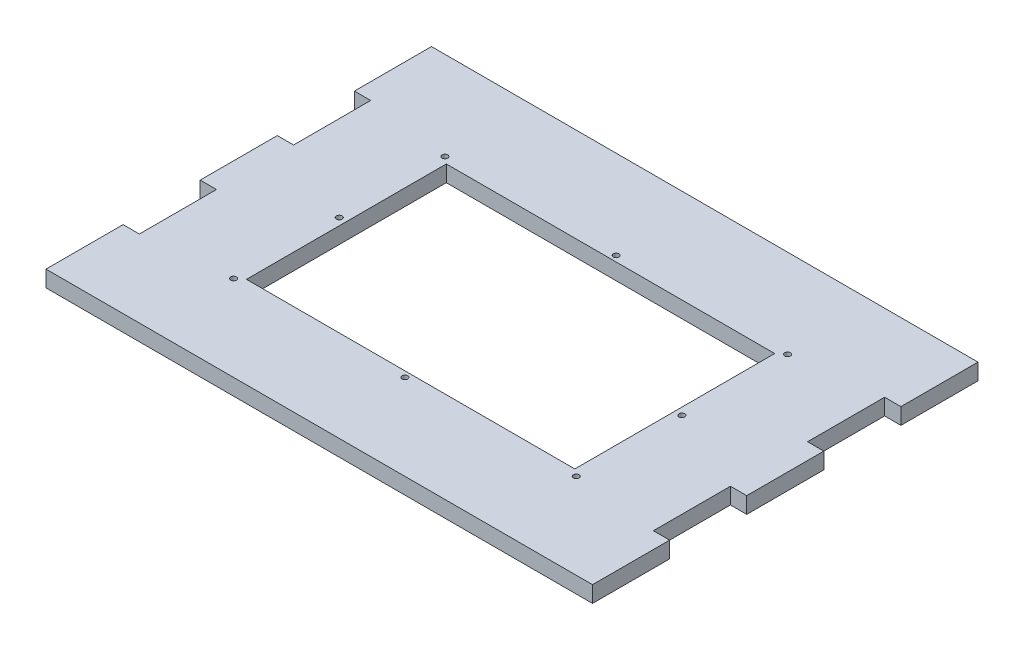
ISO-10303-21;
HEADER;
FILE_DESCRIPTION(('STEP AP214'),'2;1');
FILE_NAME('part.step','',(''),(''),'','','');
FILE_SCHEMA(('AUTOMOTIVE_DESIGN { 1 0 10303 214 1 1 1 1 }'));
ENDSEC;
DATA;
#1=APPLICATION_CONTEXT('core data for automotive mechanical design processes');
#2=APPLICATION_PROTOCOL_DEFINITION('international standard','automotive_design',2000,#1);
#3=PRODUCT_CONTEXT('',#1,'mechanical');
#4=PRODUCT('Part','Part','',(#3));
#5=PRODUCT_RELATED_PRODUCT_CATEGORY('part','',(#4));
#6=PRODUCT_DEFINITION_FORMATION('','',#4);
#7=PRODUCT_DEFINITION_CONTEXT('part definition',#1,'design');
#8=PRODUCT_DEFINITION('design','',#6,#7);
#9=PRODUCT_DEFINITION_SHAPE('','',#8);
#10=(LENGTH_UNIT() NAMED_UNIT(*) SI_UNIT(.MILLI.,.METRE.));
#11=(NAMED_UNIT(*) PLANE_ANGLE_UNIT() SI_UNIT($,.RADIAN.));
#12=(NAMED_UNIT(*) SI_UNIT($,.STERADIAN.) SOLID_ANGLE_UNIT());
#13=UNCERTAINTY_MEASURE_WITH_UNIT(LENGTH_MEASURE(1.E-05),#10,'distance_accuracy_value','');
#14=(GEOMETRIC_REPRESENTATION_CONTEXT(3) GLOBAL_UNCERTAINTY_ASSIGNED_CONTEXT((#13)) GLOBAL_UNIT_ASSIGNED_CONTEXT((#10,
#11,#12)) REPRESENTATION_CONTEXT('',''));
#15=CARTESIAN_POINT('',(0.,0.,0.));
#16=DIRECTION('',(0.,0.,1.));
#17=DIRECTION('',(1.,0.,0.));
#18=AXIS2_PLACEMENT_3D('',#15,#16,#17);
#19=CARTESIAN_POINT('',(0.,5.7,0.));
#20=DIRECTION('',(0.,-1.,0.));
#21=DIRECTION('',(0.,0.,-1.));
#22=AXIS2_PLACEMENT_3D('',#19,#20,#21);
#23=PLANE('',#22);
#24=CARTESIAN_POINT('',(90.,5.7,-90.));
#25=DIRECTION('',(0.,-1.,0.));
#26=DIRECTION('',(0.,0.,-1.));
#27=AXIS2_PLACEMENT_3D('',#24,#25,#26);
#28=CIRCLE('',#27,0.999999999999998);
#29=CARTESIAN_POINT('',(90.,5.7,-91.));
#30=VERTEX_POINT('',#29);
#31=EDGE_CURVE('E332',#30,#30,#28,.F.);
#32=ORIENTED_EDGE('',*,*,#31,.F.);
#33=EDGE_LOOP('',(#32));
#34=FACE_BOUND('',#33,.T.);
#35=CARTESIAN_POINT('',(150.,5.7,-90.));
#36=DIRECTION('',(0.,-1.,0.));
#37=DIRECTION('',(0.,0.,-1.));
#38=AXIS2_PLACEMENT_3D('',#35,#36,#37);
#39=CIRCLE('',#38,0.999999999999998);
#40=CARTESIAN_POINT('',(150.,5.7,-91.));
#41=VERTEX_POINT('',#40);
#42=EDGE_CURVE('E338',#41,#41,#39,.F.);
#43=ORIENTED_EDGE('',*,*,#42,.F.);
#44=EDGE_LOOP('',(#43));
#45=FACE_BOUND('',#44,.T.);
#46=CARTESIAN_POINT('',(150.,5.7,-53.));
#47=DIRECTION('',(0.,-1.,0.));
#48=DIRECTION('',(0.,0.,-1.));
#49=AXIS2_PLACEMENT_3D('',#46,#47,#48);
#50=CIRCLE('',#49,0.999999999999998);
#51=CARTESIAN_POINT('',(150.,5.7,-54.));
#52=VERTEX_POINT('',#51);
#53=EDGE_CURVE('E344',#52,#52,#50,.F.);
#54=ORIENTED_EDGE('',*,*,#53,.F.);
#55=EDGE_LOOP('',(#54));
#56=FACE_BOUND('',#55,.T.);
#57=CARTESIAN_POINT('',(150.,5.7,-16.));
#58=DIRECTION('',(0.,-1.,0.));
#59=DIRECTION('',(0.,0.,-1.));
#60=AXIS2_PLACEMENT_3D('',#57,#58,#59);
#61=CIRCLE('',#60,0.999999999999998);
#62=CARTESIAN_POINT('',(150.,5.7,-17.));
#63=VERTEX_POINT('',#62);
#64=EDGE_CURVE('E350',#63,#63,#61,.F.);
#65=ORIENTED_EDGE('',*,*,#64,.F.);
#66=EDGE_LOOP('',(#65));
#67=FACE_BOUND('',#66,.T.);
#68=CARTESIAN_POINT('',(90.,5.7,-16.));
#69=DIRECTION('',(0.,-1.,0.));
#70=DIRECTION('',(0.,0.,-1.));
#71=AXIS2_PLACEMENT_3D('',#68,#69,#70);
#72=CIRCLE('',#71,0.999999999999998);
#73=CARTESIAN_POINT('',(90.,5.7,-17.));
#74=VERTEX_POINT('',#73);
#75=EDGE_CURVE('E356',#74,#74,#72,.F.);
#76=ORIENTED_EDGE('',*,*,#75,.F.);
#77=EDGE_LOOP('',(#76));
#78=FACE_BOUND('',#77,.T.);
#79=CARTESIAN_POINT('',(30.,5.7,-16.));
#80=DIRECTION('',(0.,-1.,0.));
#81=DIRECTION('',(0.,0.,-1.));
#82=AXIS2_PLACEMENT_3D('',#79,#80,#81);
#83=CIRCLE('',#82,1.);
#84=CARTESIAN_POINT('',(30.,5.7,-17.));
#85=VERTEX_POINT('',#84);
#86=EDGE_CURVE('E362',#85,#85,#83,.F.);
#87=ORIENTED_EDGE('',*,*,#86,.F.);
#88=EDGE_LOOP('',(#87));
#89=FACE_BOUND('',#88,.T.);
#90=CARTESIAN_POINT('',(30.,5.7,-53.));
#91=DIRECTION('',(0.,-1.,0.));
#92=DIRECTION('',(0.,0.,-1.));
#93=AXIS2_PLACEMENT_3D('',#90,#91,#92);
#94=CIRCLE('',#93,1.);
#95=CARTESIAN_POINT('',(30.,5.7,-54.));
#96=VERTEX_POINT('',#95);
#97=EDGE_CURVE('E368',#96,#96,#94,.F.);
#98=ORIENTED_EDGE('',*,*,#97,.F.);
#99=EDGE_LOOP('',(#98));
#100=FACE_BOUND('',#99,.T.);
#101=CARTESIAN_POINT('',(30.,5.7,-90.));
#102=DIRECTION('',(0.,-1.,0.));
#103=DIRECTION('',(0.,0.,-1.));
#104=AXIS2_PLACEMENT_3D('',#101,#102,#103);
#105=CIRCLE('',#104,1.);
#106=CARTESIAN_POINT('',(30.,5.7,-91.));
#107=VERTEX_POINT('',#106);
#108=EDGE_CURVE('E374',#107,#107,#105,.F.);
#109=ORIENTED_EDGE('',*,*,#108,.F.);
#110=EDGE_LOOP('',(#109));
#111=FACE_BOUND('',#110,.T.);
#112=DIRECTION('',(0.,0.,-1.));
#113=VECTOR('',#112,1.);
#114=CARTESIAN_POINT('',(147.5,5.7,0.));
#115=LINE('',#114,#113);
#116=CARTESIAN_POINT('',(147.5,5.7,-18.));
#117=VERTEX_POINT('',#116);
#118=CARTESIAN_POINT('',(147.5,5.7,-88.));
#119=VERTEX_POINT('',#118);
#120=EDGE_CURVE('E405',#117,#119,#115,.T.);
#121=ORIENTED_EDGE('',*,*,#120,.F.);
#122=DIRECTION('',(1.,0.,0.));
#123=VECTOR('',#122,1.);
#124=CARTESIAN_POINT('',(0.,5.7,-18.));
#125=LINE('',#124,#123);
#126=CARTESIAN_POINT('',(32.5,5.7,-18.));
#127=VERTEX_POINT('',#126);
#128=EDGE_CURVE('E398',#127,#117,#125,.T.);
#129=ORIENTED_EDGE('',*,*,#128,.F.);
#130=DIRECTION('',(0.,0.,1.));
#131=VECTOR('',#130,1.);
#132=CARTESIAN_POINT('',(32.5,5.7,0.));
#133=LINE('',#132,#131);
#134=CARTESIAN_POINT('',(32.5,5.7,-88.));
#135=VERTEX_POINT('',#134);
#136=EDGE_CURVE('E400',#135,#127,#133,.T.);
#137=ORIENTED_EDGE('',*,*,#136,.F.);
#138=DIRECTION('',(-1.,0.,0.));
#139=VECTOR('',#138,1.);
#140=CARTESIAN_POINT('',(0.,5.7,-88.));
#141=LINE('',#140,#139);
#142=EDGE_CURVE('E403',#119,#135,#141,.T.);
#143=ORIENTED_EDGE('',*,*,#142,.F.);
#144=EDGE_LOOP('',(#121,#129,#137,#143));
#145=FACE_BOUND('',#144,.T.);
#146=DIRECTION('',(0.,0.,1.));
#147=VECTOR('',#146,1.);
#148=CARTESIAN_POINT('',(185.7,5.7,0.));
#149=LINE('',#148,#147);
#150=CARTESIAN_POINT('',(185.7,5.7,-121.));
#151=VERTEX_POINT('',#150);
#152=CARTESIAN_POINT('',(185.7,5.7,-94.));
#153=VERTEX_POINT('',#152);
#154=EDGE_CURVE('E196',#151,#153,#149,.T.);
#155=ORIENTED_EDGE('',*,*,#154,.F.);
#156=DIRECTION('',(-1.,0.,0.));
#157=VECTOR('',#156,1.);
#158=CARTESIAN_POINT('',(-6.,5.7,-121.));
#159=LINE('',#158,#157);
#160=CARTESIAN_POINT('',(-5.7,5.7,-121.));
#161=VERTEX_POINT('',#160);
#162=EDGE_CURVE('E56',#151,#161,#159,.T.);
#163=ORIENTED_EDGE('',*,*,#162,.T.);
#164=DIRECTION('',(0.,0.,-1.));
#165=VECTOR('',#164,1.);
#166=CARTESIAN_POINT('',(-5.7,5.7,0.));
#167=LINE('',#166,#165);
#168=CARTESIAN_POINT('',(-5.7,5.7,-94.));
#169=VERTEX_POINT('',#168);
#170=EDGE_CURVE('E311',#169,#161,#167,.T.);
#171=ORIENTED_EDGE('',*,*,#170,.F.);
#172=DIRECTION('',(-1.,0.,0.));
#173=VECTOR('',#172,1.);
#174=CARTESIAN_POINT('',(0.,5.7,-94.));
#175=LINE('',#174,#173);
#176=CARTESIAN_POINT('',(0.,5.7,-94.));
#177=VERTEX_POINT('',#176);
#178=EDGE_CURVE('E315',#177,#169,#175,.T.);
#179=ORIENTED_EDGE('',*,*,#178,.F.);
#180=DIRECTION('',(0.,0.,-1.));
#181=VECTOR('',#180,1.);
#182=CARTESIAN_POINT('',(0.,5.7,0.));
#183=LINE('',#182,#181);
#184=CARTESIAN_POINT('',(0.,5.7,-67.));
#185=VERTEX_POINT('',#184);
#186=EDGE_CURVE('E317',#185,#177,#183,.T.);
#187=ORIENTED_EDGE('',*,*,#186,.F.);
#188=DIRECTION('',(1.,0.,0.));
#189=VECTOR('',#188,1.);
#190=CARTESIAN_POINT('',(0.,5.7,-67.));
#191=LINE('',#190,#189);
#192=CARTESIAN_POINT('',(-5.7,5.7,-67.));
#193=VERTEX_POINT('',#192);
#194=EDGE_CURVE('E319',#193,#185,#191,.T.);
#195=ORIENTED_EDGE('',*,*,#194,.F.);
#196=DIRECTION('',(0.,0.,-1.));
#197=VECTOR('',#196,1.);
#198=CARTESIAN_POINT('',(-5.7,5.7,0.));
#199=LINE('',#198,#197);
#200=CARTESIAN_POINT('',(-5.7,5.7,-40.));
#201=VERTEX_POINT('',#200);
#202=EDGE_CURVE('E321',#201,#193,#199,.T.);
#203=ORIENTED_EDGE('',*,*,#202,.F.);
#204=DIRECTION('',(-1.,0.,0.));
#205=VECTOR('',#204,1.);
#206=CARTESIAN_POINT('',(0.,5.7,-40.));
#207=LINE('',#206,#205);
#208=CARTESIAN_POINT('',(0.,5.7,-40.));
#209=VERTEX_POINT('',#208);
#210=EDGE_CURVE('E323',#209,#201,#207,.T.);
#211=ORIENTED_EDGE('',*,*,#210,.F.);
#212=DIRECTION('',(0.,0.,-1.));
#213=VECTOR('',#212,1.);
#214=CARTESIAN_POINT('',(0.,5.7,0.));
#215=LINE('',#214,#213);
#216=CARTESIAN_POINT('',(0.,5.7,-13.));
#217=VERTEX_POINT('',#216);
#218=EDGE_CURVE('E325',#217,#209,#215,.T.);
#219=ORIENTED_EDGE('',*,*,#218,.F.);
#220=DIRECTION('',(1.,0.,0.));
#221=VECTOR('',#220,1.);
#222=CARTESIAN_POINT('',(0.,5.7,-13.));
#223=LINE('',#222,#221);
#224=CARTESIAN_POINT('',(-5.7,5.7,-13.));
#225=VERTEX_POINT('',#224);
#226=EDGE_CURVE('E327',#225,#217,#223,.T.);
#227=ORIENTED_EDGE('',*,*,#226,.F.);
#228=DIRECTION('',(0.,0.,-1.));
#229=VECTOR('',#228,1.);
#230=CARTESIAN_POINT('',(-5.7,5.7,0.));
#231=LINE('',#230,#229);
#232=CARTESIAN_POINT('',(-5.7,5.7,14.));
#233=VERTEX_POINT('',#232);
#234=EDGE_CURVE('E313',#233,#225,#231,.T.);
#235=ORIENTED_EDGE('',*,*,#234,.F.);
#236=DIRECTION('',(1.,0.,0.));
#237=VECTOR('',#236,1.);
#238=CARTESIAN_POINT('',(-6.,5.7,14.));
#239=LINE('',#238,#237);
#240=CARTESIAN_POINT('',(185.7,5.7,14.));
#241=VERTEX_POINT('',#240);
#242=EDGE_CURVE('E408',#233,#241,#239,.T.);
#243=ORIENTED_EDGE('',*,*,#242,.T.);
#244=DIRECTION('',(0.,0.,1.));
#245=VECTOR('',#244,1.);
#246=CARTESIAN_POINT('',(185.7,5.7,0.));
#247=LINE('',#246,#245);
#248=CARTESIAN_POINT('',(185.7,5.7,-13.));
#249=VERTEX_POINT('',#248);
#250=EDGE_CURVE('E253',#249,#241,#247,.T.);
#251=ORIENTED_EDGE('',*,*,#250,.F.);
#252=DIRECTION('',(1.,0.,0.));
#253=VECTOR('',#252,1.);
#254=CARTESIAN_POINT('',(0.,5.7,-12.9999999999993));
#255=LINE('',#254,#253);
#256=CARTESIAN_POINT('',(180.,5.7,-13.));
#257=VERTEX_POINT('',#256);
#258=EDGE_CURVE('E255',#257,#249,#255,.T.);
#259=ORIENTED_EDGE('',*,*,#258,.F.);
#260=DIRECTION('',(0.,0.,1.));
#261=VECTOR('',#260,1.);
#262=CARTESIAN_POINT('',(180.,5.7,0.));
#263=LINE('',#262,#261);
#264=CARTESIAN_POINT('',(180.,5.7,-40.));
#265=VERTEX_POINT('',#264);
#266=EDGE_CURVE('E257',#265,#257,#263,.T.);
#267=ORIENTED_EDGE('',*,*,#266,.F.);
#268=DIRECTION('',(-1.,0.,0.));
#269=VECTOR('',#268,1.);
#270=CARTESIAN_POINT('',(-1.4608197692436E-13,5.7,-39.9999999999993));
#271=LINE('',#270,#269);
#272=CARTESIAN_POINT('',(185.7,5.7,-40.));
#273=VERTEX_POINT('',#272);
#274=EDGE_CURVE('E259',#273,#265,#271,.T.);
#275=ORIENTED_EDGE('',*,*,#274,.F.);
#276=DIRECTION('',(0.,0.,1.));
#277=VECTOR('',#276,1.);
#278=CARTESIAN_POINT('',(185.7,5.7,0.));
#279=LINE('',#278,#277);
#280=CARTESIAN_POINT('',(185.7,5.7,-67.));
#281=VERTEX_POINT('',#280);
#282=EDGE_CURVE('E261',#281,#273,#279,.T.);
#283=ORIENTED_EDGE('',*,*,#282,.F.);
#284=DIRECTION('',(1.,0.,0.));
#285=VECTOR('',#284,1.);
#286=CARTESIAN_POINT('',(-3.26249748464405E-13,5.7,-66.9999999999991));
#287=LINE('',#286,#285);
#288=CARTESIAN_POINT('',(180.,5.7,-67.));
#289=VERTEX_POINT('',#288);
#290=EDGE_CURVE('E263',#289,#281,#287,.T.);
#291=ORIENTED_EDGE('',*,*,#290,.F.);
#292=DIRECTION('',(0.,0.,1.));
#293=VECTOR('',#292,1.);
#294=CARTESIAN_POINT('',(180.,5.7,0.));
#295=LINE('',#294,#293);
#296=CARTESIAN_POINT('',(180.,5.7,-94.));
#297=VERTEX_POINT('',#296);
#298=EDGE_CURVE('E265',#297,#289,#295,.T.);
#299=ORIENTED_EDGE('',*,*,#298,.F.);
#300=DIRECTION('',(-1.,0.,0.));
#301=VECTOR('',#300,1.);
#302=CARTESIAN_POINT('',(-4.57723527696334E-13,5.7,-93.9999999999991));
#303=LINE('',#302,#301);
#304=EDGE_CURVE('E267',#153,#297,#303,.T.);
#305=ORIENTED_EDGE('',*,*,#304,.F.);
#306=EDGE_LOOP('',(#155,#163,#171,#179,#187,#195,#203,#211,#219,#227,#235,#243,#251,#259,#267,
#275,#283,#291,#299,#305));
#307=FACE_BOUND('',#306,.T.);
#308=ADVANCED_FACE('F33',(#34,#45,#56,#67,#78,#89,#100,#111,#145,#307),#23,.F.);
#309=CARTESIAN_POINT('',(0.,0.,0.));
#310=DIRECTION('',(0.,-1.,0.));
#311=DIRECTION('',(0.,0.,-1.));
#312=AXIS2_PLACEMENT_3D('',#309,#310,#311);
#313=PLANE('',#312);
#314=CARTESIAN_POINT('',(90.,0.,-90.));
#315=DIRECTION('',(0.,1.,0.));
#316=DIRECTION('',(0.,0.,1.));
#317=AXIS2_PLACEMENT_3D('',#314,#315,#316);
#318=CIRCLE('',#317,0.999999999999998);
#319=CARTESIAN_POINT('',(90.,0.,-89.));
#320=VERTEX_POINT('',#319);
#321=EDGE_CURVE('E329',#320,#320,#318,.T.);
#322=ORIENTED_EDGE('',*,*,#321,.T.);
#323=EDGE_LOOP('',(#322));
#324=FACE_BOUND('',#323,.T.);
#325=CARTESIAN_POINT('',(150.,0.,-90.));
#326=DIRECTION('',(0.,1.,0.));
#327=DIRECTION('',(0.,0.,1.));
#328=AXIS2_PLACEMENT_3D('',#325,#326,#327);
#329=CIRCLE('',#328,0.999999999999998);
#330=CARTESIAN_POINT('',(150.,0.,-89.));
#331=VERTEX_POINT('',#330);
#332=EDGE_CURVE('E335',#331,#331,#329,.T.);
#333=ORIENTED_EDGE('',*,*,#332,.T.);
#334=EDGE_LOOP('',(#333));
#335=FACE_BOUND('',#334,.T.);
#336=CARTESIAN_POINT('',(150.,0.,-53.));
#337=DIRECTION('',(0.,1.,0.));
#338=DIRECTION('',(0.,0.,1.));
#339=AXIS2_PLACEMENT_3D('',#336,#337,#338);
#340=CIRCLE('',#339,0.999999999999998);
#341=CARTESIAN_POINT('',(150.,0.,-52.));
#342=VERTEX_POINT('',#341);
#343=EDGE_CURVE('E341',#342,#342,#340,.T.);
#344=ORIENTED_EDGE('',*,*,#343,.T.);
#345=EDGE_LOOP('',(#344));
#346=FACE_BOUND('',#345,.T.);
#347=CARTESIAN_POINT('',(150.,0.,-16.));
#348=DIRECTION('',(0.,1.,0.));
#349=DIRECTION('',(0.,0.,1.));
#350=AXIS2_PLACEMENT_3D('',#347,#348,#349);
#351=CIRCLE('',#350,0.999999999999998);
#352=CARTESIAN_POINT('',(150.,0.,-15.));
#353=VERTEX_POINT('',#352);
#354=EDGE_CURVE('E347',#353,#353,#351,.T.);
#355=ORIENTED_EDGE('',*,*,#354,.T.);
#356=EDGE_LOOP('',(#355));
#357=FACE_BOUND('',#356,.T.);
#358=CARTESIAN_POINT('',(90.,0.,-16.));
#359=DIRECTION('',(0.,1.,0.));
#360=DIRECTION('',(0.,0.,1.));
#361=AXIS2_PLACEMENT_3D('',#358,#359,#360);
#362=CIRCLE('',#361,0.999999999999998);
#363=CARTESIAN_POINT('',(90.,0.,-15.));
#364=VERTEX_POINT('',#363);
#365=EDGE_CURVE('E353',#364,#364,#362,.T.);
#366=ORIENTED_EDGE('',*,*,#365,.T.);
#367=EDGE_LOOP('',(#366));
#368=FACE_BOUND('',#367,.T.);
#369=CARTESIAN_POINT('',(30.,0.,-16.));
#370=DIRECTION('',(0.,1.,0.));
#371=DIRECTION('',(0.,0.,1.));
#372=AXIS2_PLACEMENT_3D('',#369,#370,#371);
#373=CIRCLE('',#372,1.);
#374=CARTESIAN_POINT('',(30.,0.,-15.));
#375=VERTEX_POINT('',#374);
#376=EDGE_CURVE('E359',#375,#375,#373,.T.);
#377=ORIENTED_EDGE('',*,*,#376,.T.);
#378=EDGE_LOOP('',(#377));
#379=FACE_BOUND('',#378,.T.);
#380=CARTESIAN_POINT('',(30.,0.,-53.));
#381=DIRECTION('',(0.,1.,0.));
#382=DIRECTION('',(0.,0.,1.));
#383=AXIS2_PLACEMENT_3D('',#380,#381,#382);
#384=CIRCLE('',#383,1.);
#385=CARTESIAN_POINT('',(30.,0.,-52.));
#386=VERTEX_POINT('',#385);
#387=EDGE_CURVE('E365',#386,#386,#384,.T.);
#388=ORIENTED_EDGE('',*,*,#387,.T.);
#389=EDGE_LOOP('',(#388));
#390=FACE_BOUND('',#389,.T.);
#391=CARTESIAN_POINT('',(30.,0.,-90.));
#392=DIRECTION('',(0.,1.,0.));
#393=DIRECTION('',(0.,0.,1.));
#394=AXIS2_PLACEMENT_3D('',#391,#392,#393);
#395=CIRCLE('',#394,1.);
#396=CARTESIAN_POINT('',(30.,0.,-89.));
#397=VERTEX_POINT('',#396);
#398=EDGE_CURVE('E371',#397,#397,#395,.T.);
#399=ORIENTED_EDGE('',*,*,#398,.T.);
#400=EDGE_LOOP('',(#399));
#401=FACE_BOUND('',#400,.T.);
#402=DIRECTION('',(1.,0.,0.));
#403=VECTOR('',#402,1.);
#404=CARTESIAN_POINT('',(32.5,0.,-18.));
#405=LINE('',#404,#403);
#406=CARTESIAN_POINT('',(32.5,0.,-18.));
#407=VERTEX_POINT('',#406);
#408=CARTESIAN_POINT('',(147.5,0.,-18.));
#409=VERTEX_POINT('',#408);
#410=EDGE_CURVE('E386',#407,#409,#405,.T.);
#411=ORIENTED_EDGE('',*,*,#410,.T.);
#412=DIRECTION('',(0.,0.,-1.));
#413=VECTOR('',#412,1.);
#414=CARTESIAN_POINT('',(147.5,0.,-88.));
#415=LINE('',#414,#413);
#416=CARTESIAN_POINT('',(147.5,0.,-88.));
#417=VERTEX_POINT('',#416);
#418=EDGE_CURVE('E377',#409,#417,#415,.T.);
#419=ORIENTED_EDGE('',*,*,#418,.T.);
#420=DIRECTION('',(-1.,0.,0.));
#421=VECTOR('',#420,1.);
#422=CARTESIAN_POINT('',(32.5,0.,-88.));
#423=LINE('',#422,#421);
#424=CARTESIAN_POINT('',(32.5,0.,-88.));
#425=VERTEX_POINT('',#424);
#426=EDGE_CURVE('E380',#417,#425,#423,.T.);
#427=ORIENTED_EDGE('',*,*,#426,.T.);
#428=DIRECTION('',(0.,0.,1.));
#429=VECTOR('',#428,1.);
#430=CARTESIAN_POINT('',(32.5,0.,-88.));
#431=LINE('',#430,#429);
#432=EDGE_CURVE('E383',#425,#407,#431,.T.);
#433=ORIENTED_EDGE('',*,*,#432,.T.);
#434=EDGE_LOOP('',(#411,#419,#427,#433));
#435=FACE_BOUND('',#434,.T.);
#436=DIRECTION('',(-1.,0.,0.));
#437=VECTOR('',#436,1.);
#438=CARTESIAN_POINT('',(-6.,0.,-121.));
#439=LINE('',#438,#437);
#440=CARTESIAN_POINT('',(185.7,0.,-121.));
#441=VERTEX_POINT('',#440);
#442=CARTESIAN_POINT('',(-5.7,0.,-121.));
#443=VERTEX_POINT('',#442);
#444=EDGE_CURVE('E214',#441,#443,#439,.T.);
#445=ORIENTED_EDGE('',*,*,#444,.F.);
#446=DIRECTION('',(0.,0.,1.));
#447=VECTOR('',#446,1.);
#448=CARTESIAN_POINT('',(185.7,0.,-121.));
#449=LINE('',#448,#447);
#450=CARTESIAN_POINT('',(185.7,0.,-94.));
#451=VERTEX_POINT('',#450);
#452=EDGE_CURVE('E48',#441,#451,#449,.T.);
#453=ORIENTED_EDGE('',*,*,#452,.T.);
#454=DIRECTION('',(-1.,0.,0.));
#455=VECTOR('',#454,1.);
#456=CARTESIAN_POINT('',(185.7,0.,-94.));
#457=LINE('',#456,#455);
#458=CARTESIAN_POINT('',(180.,0.,-94.));
#459=VERTEX_POINT('',#458);
#460=EDGE_CURVE('E203',#451,#459,#457,.T.);
#461=ORIENTED_EDGE('',*,*,#460,.T.);
#462=DIRECTION('',(0.,0.,1.));
#463=VECTOR('',#462,1.);
#464=CARTESIAN_POINT('',(180.,0.,-94.));
#465=LINE('',#464,#463);
#466=CARTESIAN_POINT('',(180.,0.,-67.));
#467=VERTEX_POINT('',#466);
#468=EDGE_CURVE('E209',#459,#467,#465,.T.);
#469=ORIENTED_EDGE('',*,*,#468,.T.);
#470=DIRECTION('',(1.,0.,0.));
#471=VECTOR('',#470,1.);
#472=CARTESIAN_POINT('',(180.,0.,-67.));
#473=LINE('',#472,#471);
#474=CARTESIAN_POINT('',(185.7,0.,-67.));
#475=VERTEX_POINT('',#474);
#476=EDGE_CURVE('E218',#467,#475,#473,.T.);
#477=ORIENTED_EDGE('',*,*,#476,.T.);
#478=DIRECTION('',(0.,0.,1.));
#479=VECTOR('',#478,1.);
#480=CARTESIAN_POINT('',(185.7,0.,-67.));
#481=LINE('',#480,#479);
#482=CARTESIAN_POINT('',(185.7,0.,-40.));
#483=VERTEX_POINT('',#482);
#484=EDGE_CURVE('E221',#475,#483,#481,.T.);
#485=ORIENTED_EDGE('',*,*,#484,.T.);
#486=DIRECTION('',(-1.,0.,0.));
#487=VECTOR('',#486,1.);
#488=CARTESIAN_POINT('',(185.7,0.,-40.));
#489=LINE('',#488,#487);
#490=CARTESIAN_POINT('',(180.,0.,-40.));
#491=VERTEX_POINT('',#490);
#492=EDGE_CURVE('E224',#483,#491,#489,.T.);
#493=ORIENTED_EDGE('',*,*,#492,.T.);
#494=DIRECTION('',(0.,0.,1.));
#495=VECTOR('',#494,1.);
#496=CARTESIAN_POINT('',(180.,0.,-40.));
#497=LINE('',#496,#495);
#498=CARTESIAN_POINT('',(180.,0.,-13.));
#499=VERTEX_POINT('',#498);
#500=EDGE_CURVE('E227',#491,#499,#497,.T.);
#501=ORIENTED_EDGE('',*,*,#500,.T.);
#502=DIRECTION('',(1.,0.,0.));
#503=VECTOR('',#502,1.);
#504=CARTESIAN_POINT('',(180.,0.,-13.));
#505=LINE('',#504,#503);
#506=CARTESIAN_POINT('',(185.7,0.,-13.));
#507=VERTEX_POINT('',#506);
#508=EDGE_CURVE('E230',#499,#507,#505,.T.);
#509=ORIENTED_EDGE('',*,*,#508,.T.);
#510=DIRECTION('',(0.,0.,1.));
#511=VECTOR('',#510,1.);
#512=CARTESIAN_POINT('',(185.7,0.,-13.));
#513=LINE('',#512,#511);
#514=CARTESIAN_POINT('',(185.7,0.,14.));
#515=VERTEX_POINT('',#514);
#516=EDGE_CURVE('E233',#507,#515,#513,.T.);
#517=ORIENTED_EDGE('',*,*,#516,.T.);
#518=DIRECTION('',(1.,0.,0.));
#519=VECTOR('',#518,1.);
#520=CARTESIAN_POINT('',(-6.,0.,14.));
#521=LINE('',#520,#519);
#522=CARTESIAN_POINT('',(-5.7,0.,14.));
#523=VERTEX_POINT('',#522);
#524=EDGE_CURVE('E407',#523,#515,#521,.T.);
#525=ORIENTED_EDGE('',*,*,#524,.F.);
#526=DIRECTION('',(0.,0.,-1.));
#527=VECTOR('',#526,1.);
#528=CARTESIAN_POINT('',(-5.7,0.,-13.));
#529=LINE('',#528,#527);
#530=CARTESIAN_POINT('',(-5.7,0.,-13.));
#531=VERTEX_POINT('',#530);
#532=EDGE_CURVE('E269',#523,#531,#529,.T.);
#533=ORIENTED_EDGE('',*,*,#532,.T.);
#534=DIRECTION('',(1.,0.,0.));
#535=VECTOR('',#534,1.);
#536=CARTESIAN_POINT('',(0.,0.,-13.));
#537=LINE('',#536,#535);
#538=CARTESIAN_POINT('',(0.,0.,-13.));
#539=VERTEX_POINT('',#538);
#540=EDGE_CURVE('E272',#531,#539,#537,.T.);
#541=ORIENTED_EDGE('',*,*,#540,.T.);
#542=DIRECTION('',(0.,0.,-1.));
#543=VECTOR('',#542,1.);
#544=CARTESIAN_POINT('',(0.,0.,-40.));
#545=LINE('',#544,#543);
#546=CARTESIAN_POINT('',(0.,0.,-40.));
#547=VERTEX_POINT('',#546);
#548=EDGE_CURVE('E275',#539,#547,#545,.T.);
#549=ORIENTED_EDGE('',*,*,#548,.T.);
#550=DIRECTION('',(-1.,0.,0.));
#551=VECTOR('',#550,1.);
#552=CARTESIAN_POINT('',(-5.7,0.,-40.));
#553=LINE('',#552,#551);
#554=CARTESIAN_POINT('',(-5.7,0.,-40.));
#555=VERTEX_POINT('',#554);
#556=EDGE_CURVE('E278',#547,#555,#553,.T.);
#557=ORIENTED_EDGE('',*,*,#556,.T.);
#558=DIRECTION('',(0.,0.,-1.));
#559=VECTOR('',#558,1.);
#560=CARTESIAN_POINT('',(-5.7,0.,-67.));
#561=LINE('',#560,#559);
#562=CARTESIAN_POINT('',(-5.7,0.,-67.));
#563=VERTEX_POINT('',#562);
#564=EDGE_CURVE('E281',#555,#563,#561,.T.);
#565=ORIENTED_EDGE('',*,*,#564,.T.);
#566=DIRECTION('',(1.,0.,0.));
#567=VECTOR('',#566,1.);
#568=CARTESIAN_POINT('',(0.,0.,-67.));
#569=LINE('',#568,#567);
#570=CARTESIAN_POINT('',(0.,0.,-67.));
#571=VERTEX_POINT('',#570);
#572=EDGE_CURVE('E284',#563,#571,#569,.T.);
#573=ORIENTED_EDGE('',*,*,#572,.T.);
#574=DIRECTION('',(0.,0.,-1.));
#575=VECTOR('',#574,1.);
#576=CARTESIAN_POINT('',(0.,0.,-94.));
#577=LINE('',#576,#575);
#578=CARTESIAN_POINT('',(0.,0.,-94.));
#579=VERTEX_POINT('',#578);
#580=EDGE_CURVE('E287',#571,#579,#577,.T.);
#581=ORIENTED_EDGE('',*,*,#580,.T.);
#582=DIRECTION('',(-1.,0.,0.));
#583=VECTOR('',#582,1.);
#584=CARTESIAN_POINT('',(-5.7,0.,-94.));
#585=LINE('',#584,#583);
#586=CARTESIAN_POINT('',(-5.7,0.,-94.));
#587=VERTEX_POINT('',#586);
#588=EDGE_CURVE('E290',#579,#587,#585,.T.);
#589=ORIENTED_EDGE('',*,*,#588,.T.);
#590=DIRECTION('',(0.,0.,-1.));
#591=VECTOR('',#590,1.);
#592=CARTESIAN_POINT('',(-5.7,0.,-121.));
#593=LINE('',#592,#591);
#594=EDGE_CURVE('E293',#587,#443,#593,.T.);
#595=ORIENTED_EDGE('',*,*,#594,.T.);
#596=EDGE_LOOP('',(#445,#453,#461,#469,#477,#485,#493,#501,#509,#517,#525,#533,#541,#549,#557,
#565,#573,#581,#589,#595));
#597=FACE_BOUND('',#596,.T.);
#598=ADVANCED_FACE('F212',(#324,#335,#346,#357,#368,#379,#390,#401,#435,#597),#313,.T.);
#599=CARTESIAN_POINT('',(-6.,5.7,14.));
#600=DIRECTION('',(0.,0.,-1.));
#601=DIRECTION('',(-1.,0.,0.));
#602=AXIS2_PLACEMENT_3D('',#599,#600,#601);
#603=PLANE('',#602);
#604=DIRECTION('',(0.,-1.,0.));
#605=VECTOR('',#604,1.);
#606=CARTESIAN_POINT('',(185.7,11.,14.));
#607=LINE('',#606,#605);
#608=EDGE_CURVE('E236',#241,#515,#607,.T.);
#609=ORIENTED_EDGE('',*,*,#608,.F.);
#610=ORIENTED_EDGE('',*,*,#242,.F.);
#611=DIRECTION('',(0.,1.,0.));
#612=VECTOR('',#611,1.);
#613=CARTESIAN_POINT('',(-5.7,5.7,14.));
#614=LINE('',#613,#612);
#615=EDGE_CURVE('E11',#523,#233,#614,.T.);
#616=ORIENTED_EDGE('',*,*,#615,.F.);
#617=ORIENTED_EDGE('',*,*,#524,.T.);
#618=EDGE_LOOP('',(#609,#610,#616,#617));
#619=FACE_BOUND('',#618,.T.);
#620=ADVANCED_FACE('F35',(#619),#603,.F.);
#621=CARTESIAN_POINT('',(-6.,5.7,-121.));
#622=DIRECTION('',(0.,0.,1.));
#623=DIRECTION('',(1.,0.,0.));
#624=AXIS2_PLACEMENT_3D('',#621,#622,#623);
#625=PLANE('',#624);
#626=DIRECTION('',(0.,-1.,0.));
#627=VECTOR('',#626,1.);
#628=CARTESIAN_POINT('',(185.7,11.,-121.));
#629=LINE('',#628,#627);
#630=EDGE_CURVE('E199',#151,#441,#629,.T.);
#631=ORIENTED_EDGE('',*,*,#630,.T.);
#632=ORIENTED_EDGE('',*,*,#444,.T.);
#633=DIRECTION('',(0.,-1.,0.));
#634=VECTOR('',#633,1.);
#635=CARTESIAN_POINT('',(-5.7,5.7,-121.));
#636=LINE('',#635,#634);
#637=EDGE_CURVE('E41',#161,#443,#636,.T.);
#638=ORIENTED_EDGE('',*,*,#637,.F.);
#639=ORIENTED_EDGE('',*,*,#162,.F.);
#640=EDGE_LOOP('',(#631,#632,#638,#639));
#641=FACE_BOUND('',#640,.T.);
#642=ADVANCED_FACE('F517',(#641),#625,.F.);
#643=CARTESIAN_POINT('',(147.5,47.,-88.));
#644=DIRECTION('',(-1.,0.,0.));
#645=DIRECTION('',(0.,0.,1.));
#646=AXIS2_PLACEMENT_3D('',#643,#644,#645);
#647=PLANE('',#646);
#648=ORIENTED_EDGE('',*,*,#120,.T.);
#649=DIRECTION('',(0.,-1.,0.));
#650=VECTOR('',#649,1.);
#651=CARTESIAN_POINT('',(147.5,47.,-88.));
#652=LINE('',#651,#650);
#653=EDGE_CURVE('E396',#119,#417,#652,.T.);
#654=ORIENTED_EDGE('',*,*,#653,.T.);
#655=ORIENTED_EDGE('',*,*,#418,.F.);
#656=DIRECTION('',(0.,-1.,0.));
#657=VECTOR('',#656,1.);
#658=CARTESIAN_POINT('',(147.5,47.,-18.));
#659=LINE('',#658,#657);
#660=EDGE_CURVE('E389',#117,#409,#659,.T.);
#661=ORIENTED_EDGE('',*,*,#660,.F.);
#662=EDGE_LOOP('',(#648,#654,#655,#661));
#663=FACE_BOUND('',#662,.T.);
#664=ADVANCED_FACE('F515',(#663),#647,.T.);
#665=CARTESIAN_POINT('',(32.5,47.,-88.));
#666=DIRECTION('',(0.,0.,1.));
#667=DIRECTION('',(1.,0.,0.));
#668=AXIS2_PLACEMENT_3D('',#665,#666,#667);
#669=PLANE('',#668);
#670=ORIENTED_EDGE('',*,*,#142,.T.);
#671=DIRECTION('',(0.,-1.,0.));
#672=VECTOR('',#671,1.);
#673=CARTESIAN_POINT('',(32.5,47.,-88.));
#674=LINE('',#673,#672);
#675=EDGE_CURVE('E394',#135,#425,#674,.T.);
#676=ORIENTED_EDGE('',*,*,#675,.T.);
#677=ORIENTED_EDGE('',*,*,#426,.F.);
#678=ORIENTED_EDGE('',*,*,#653,.F.);
#679=EDGE_LOOP('',(#670,#676,#677,#678));
#680=FACE_BOUND('',#679,.T.);
#681=ADVANCED_FACE('F523',(#680),#669,.T.);
#682=CARTESIAN_POINT('',(32.5,47.,-88.));
#683=DIRECTION('',(1.,0.,0.));
#684=DIRECTION('',(0.,0.,-1.));
#685=AXIS2_PLACEMENT_3D('',#682,#683,#684);
#686=PLANE('',#685);
#687=ORIENTED_EDGE('',*,*,#136,.T.);
#688=DIRECTION('',(0.,-1.,0.));
#689=VECTOR('',#688,1.);
#690=CARTESIAN_POINT('',(32.5,47.,-18.));
#691=LINE('',#690,#689);
#692=EDGE_CURVE('E392',#127,#407,#691,.T.);
#693=ORIENTED_EDGE('',*,*,#692,.T.);
#694=ORIENTED_EDGE('',*,*,#432,.F.);
#695=ORIENTED_EDGE('',*,*,#675,.F.);
#696=EDGE_LOOP('',(#687,#693,#694,#695));
#697=FACE_BOUND('',#696,.T.);
#698=ADVANCED_FACE('F628',(#697),#686,.T.);
#699=CARTESIAN_POINT('',(32.5,47.,-18.));
#700=DIRECTION('',(0.,0.,-1.));
#701=DIRECTION('',(-1.,0.,0.));
#702=AXIS2_PLACEMENT_3D('',#699,#700,#701);
#703=PLANE('',#702);
#704=ORIENTED_EDGE('',*,*,#128,.T.);
#705=ORIENTED_EDGE('',*,*,#660,.T.);
#706=ORIENTED_EDGE('',*,*,#410,.F.);
#707=ORIENTED_EDGE('',*,*,#692,.F.);
#708=EDGE_LOOP('',(#704,#705,#706,#707));
#709=FACE_BOUND('',#708,.T.);
#710=ADVANCED_FACE('F618',(#709),#703,.T.);
#711=CARTESIAN_POINT('',(30.,37.,-90.));
#712=DIRECTION('',(0.,-1.,0.));
#713=DIRECTION('',(0.,0.,-1.));
#714=AXIS2_PLACEMENT_3D('',#711,#712,#713);
#715=CYLINDRICAL_SURFACE('',#714,1.);
#716=ORIENTED_EDGE('',*,*,#398,.F.);
#717=EDGE_LOOP('',(#716));
#718=FACE_BOUND('',#717,.T.);
#719=ORIENTED_EDGE('',*,*,#108,.T.);
#720=EDGE_LOOP('',(#719));
#721=FACE_BOUND('',#720,.T.);
#722=ADVANCED_FACE('F608',(#718,#721),#715,.F.);
#723=CARTESIAN_POINT('',(30.,37.,-53.));
#724=DIRECTION('',(0.,-1.,0.));
#725=DIRECTION('',(0.,0.,-1.));
#726=AXIS2_PLACEMENT_3D('',#723,#724,#725);
#727=CYLINDRICAL_SURFACE('',#726,1.);
#728=ORIENTED_EDGE('',*,*,#387,.F.);
#729=EDGE_LOOP('',(#728));
#730=FACE_BOUND('',#729,.T.);
#731=ORIENTED_EDGE('',*,*,#97,.T.);
#732=EDGE_LOOP('',(#731));
#733=FACE_BOUND('',#732,.T.);
#734=ADVANCED_FACE('F598',(#730,#733),#727,.F.);
#735=CARTESIAN_POINT('',(30.,37.,-16.));
#736=DIRECTION('',(0.,-1.,0.));
#737=DIRECTION('',(0.,0.,-1.));
#738=AXIS2_PLACEMENT_3D('',#735,#736,#737);
#739=CYLINDRICAL_SURFACE('',#738,1.);
#740=ORIENTED_EDGE('',*,*,#376,.F.);
#741=EDGE_LOOP('',(#740));
#742=FACE_BOUND('',#741,.T.);
#743=ORIENTED_EDGE('',*,*,#86,.T.);
#744=EDGE_LOOP('',(#743));
#745=FACE_BOUND('',#744,.T.);
#746=ADVANCED_FACE('F588',(#742,#745),#739,.F.);
#747=CARTESIAN_POINT('',(90.,37.,-16.));
#748=DIRECTION('',(0.,-1.,0.));
#749=DIRECTION('',(0.,0.,-1.));
#750=AXIS2_PLACEMENT_3D('',#747,#748,#749);
#751=CYLINDRICAL_SURFACE('',#750,0.999999999999998);
#752=ORIENTED_EDGE('',*,*,#365,.F.);
#753=EDGE_LOOP('',(#752));
#754=FACE_BOUND('',#753,.T.);
#755=ORIENTED_EDGE('',*,*,#75,.T.);
#756=EDGE_LOOP('',(#755));
#757=FACE_BOUND('',#756,.T.);
#758=ADVANCED_FACE('F578',(#754,#757),#751,.F.);
#759=CARTESIAN_POINT('',(150.,37.,-16.));
#760=DIRECTION('',(0.,-1.,0.));
#761=DIRECTION('',(0.,0.,-1.));
#762=AXIS2_PLACEMENT_3D('',#759,#760,#761);
#763=CYLINDRICAL_SURFACE('',#762,0.999999999999998);
#764=ORIENTED_EDGE('',*,*,#354,.F.);
#765=EDGE_LOOP('',(#764));
#766=FACE_BOUND('',#765,.T.);
#767=ORIENTED_EDGE('',*,*,#64,.T.);
#768=EDGE_LOOP('',(#767));
#769=FACE_BOUND('',#768,.T.);
#770=ADVANCED_FACE('F568',(#766,#769),#763,.F.);
#771=CARTESIAN_POINT('',(150.,37.,-53.));
#772=DIRECTION('',(0.,-1.,0.));
#773=DIRECTION('',(0.,0.,-1.));
#774=AXIS2_PLACEMENT_3D('',#771,#772,#773);
#775=CYLINDRICAL_SURFACE('',#774,0.999999999999998);
#776=ORIENTED_EDGE('',*,*,#343,.F.);
#777=EDGE_LOOP('',(#776));
#778=FACE_BOUND('',#777,.T.);
#779=ORIENTED_EDGE('',*,*,#53,.T.);
#780=EDGE_LOOP('',(#779));
#781=FACE_BOUND('',#780,.T.);
#782=ADVANCED_FACE('F558',(#778,#781),#775,.F.);
#783=CARTESIAN_POINT('',(150.,37.,-90.));
#784=DIRECTION('',(0.,-1.,0.));
#785=DIRECTION('',(0.,0.,-1.));
#786=AXIS2_PLACEMENT_3D('',#783,#784,#785);
#787=CYLINDRICAL_SURFACE('',#786,0.999999999999998);
#788=ORIENTED_EDGE('',*,*,#332,.F.);
#789=EDGE_LOOP('',(#788));
#790=FACE_BOUND('',#789,.T.);
#791=ORIENTED_EDGE('',*,*,#42,.T.);
#792=EDGE_LOOP('',(#791));
#793=FACE_BOUND('',#792,.T.);
#794=ADVANCED_FACE('F546',(#790,#793),#787,.F.);
#795=CARTESIAN_POINT('',(90.,37.,-90.));
#796=DIRECTION('',(0.,-1.,0.));
#797=DIRECTION('',(0.,0.,-1.));
#798=AXIS2_PLACEMENT_3D('',#795,#796,#797);
#799=CYLINDRICAL_SURFACE('',#798,0.999999999999998);
#800=ORIENTED_EDGE('',*,*,#321,.F.);
#801=EDGE_LOOP('',(#800));
#802=FACE_BOUND('',#801,.T.);
#803=ORIENTED_EDGE('',*,*,#31,.T.);
#804=EDGE_LOOP('',(#803));
#805=FACE_BOUND('',#804,.T.);
#806=ADVANCED_FACE('F541',(#802,#805),#799,.F.);
#807=CARTESIAN_POINT('',(0.,11.,-13.));
#808=DIRECTION('',(0.,0.,-1.));
#809=DIRECTION('',(-1.,0.,0.));
#810=AXIS2_PLACEMENT_3D('',#807,#808,#809);
#811=PLANE('',#810);
#812=ORIENTED_EDGE('',*,*,#226,.T.);
#813=DIRECTION('',(0.,-1.,0.));
#814=VECTOR('',#813,1.);
#815=CARTESIAN_POINT('',(0.,11.,-13.));
#816=LINE('',#815,#814);
#817=EDGE_CURVE('E307',#217,#539,#816,.T.);
#818=ORIENTED_EDGE('',*,*,#817,.T.);
#819=ORIENTED_EDGE('',*,*,#540,.F.);
#820=DIRECTION('',(0.,-1.,0.));
#821=VECTOR('',#820,1.);
#822=CARTESIAN_POINT('',(-5.7,11.,-13.));
#823=LINE('',#822,#821);
#824=EDGE_CURVE('E309',#225,#531,#823,.T.);
#825=ORIENTED_EDGE('',*,*,#824,.F.);
#826=EDGE_LOOP('',(#812,#818,#819,#825));
#827=FACE_BOUND('',#826,.T.);
#828=ADVANCED_FACE('F454',(#827),#811,.T.);
#829=CARTESIAN_POINT('',(0.,11.,-40.));
#830=DIRECTION('',(-1.,0.,0.));
#831=DIRECTION('',(0.,0.,1.));
#832=AXIS2_PLACEMENT_3D('',#829,#830,#831);
#833=PLANE('',#832);
#834=ORIENTED_EDGE('',*,*,#218,.T.);
#835=DIRECTION('',(0.,-1.,0.));
#836=VECTOR('',#835,1.);
#837=CARTESIAN_POINT('',(0.,11.,-40.));
#838=LINE('',#837,#836);
#839=EDGE_CURVE('E305',#209,#547,#838,.T.);
#840=ORIENTED_EDGE('',*,*,#839,.T.);
#841=ORIENTED_EDGE('',*,*,#548,.F.);
#842=ORIENTED_EDGE('',*,*,#817,.F.);
#843=EDGE_LOOP('',(#834,#840,#841,#842));
#844=FACE_BOUND('',#843,.T.);
#845=ADVANCED_FACE('F450',(#844),#833,.T.);
#846=CARTESIAN_POINT('',(-5.7,11.,-40.));
#847=DIRECTION('',(0.,0.,1.));
#848=DIRECTION('',(1.,0.,0.));
#849=AXIS2_PLACEMENT_3D('',#846,#847,#848);
#850=PLANE('',#849);
#851=ORIENTED_EDGE('',*,*,#210,.T.);
#852=DIRECTION('',(0.,-1.,0.));
#853=VECTOR('',#852,1.);
#854=CARTESIAN_POINT('',(-5.7,11.,-40.));
#855=LINE('',#854,#853);
#856=EDGE_CURVE('E303',#201,#555,#855,.T.);
#857=ORIENTED_EDGE('',*,*,#856,.T.);
#858=ORIENTED_EDGE('',*,*,#556,.F.);
#859=ORIENTED_EDGE('',*,*,#839,.F.);
#860=EDGE_LOOP('',(#851,#857,#858,#859));
#861=FACE_BOUND('',#860,.T.);
#862=ADVANCED_FACE('F446',(#861),#850,.T.);
#863=CARTESIAN_POINT('',(-5.7,11.,-67.));
#864=DIRECTION('',(-1.,0.,0.));
#865=DIRECTION('',(0.,0.,1.));
#866=AXIS2_PLACEMENT_3D('',#863,#864,#865);
#867=PLANE('',#866);
#868=ORIENTED_EDGE('',*,*,#202,.T.);
#869=DIRECTION('',(0.,-1.,0.));
#870=VECTOR('',#869,1.);
#871=CARTESIAN_POINT('',(-5.7,11.,-67.));
#872=LINE('',#871,#870);
#873=EDGE_CURVE('E301',#193,#563,#872,.T.);
#874=ORIENTED_EDGE('',*,*,#873,.T.);
#875=ORIENTED_EDGE('',*,*,#564,.F.);
#876=ORIENTED_EDGE('',*,*,#856,.F.);
#877=EDGE_LOOP('',(#868,#874,#875,#876));
#878=FACE_BOUND('',#877,.T.);
#879=ADVANCED_FACE('F439',(#878),#867,.T.);
#880=CARTESIAN_POINT('',(0.,11.,-67.));
#881=DIRECTION('',(0.,0.,-1.));
#882=DIRECTION('',(-1.,0.,0.));
#883=AXIS2_PLACEMENT_3D('',#880,#881,#882);
#884=PLANE('',#883);
#885=ORIENTED_EDGE('',*,*,#194,.T.);
#886=DIRECTION('',(0.,-1.,0.));
#887=VECTOR('',#886,1.);
#888=CARTESIAN_POINT('',(0.,11.,-67.));
#889=LINE('',#888,#887);
#890=EDGE_CURVE('E299',#185,#571,#889,.T.);
#891=ORIENTED_EDGE('',*,*,#890,.T.);
#892=ORIENTED_EDGE('',*,*,#572,.F.);
#893=ORIENTED_EDGE('',*,*,#873,.F.);
#894=EDGE_LOOP('',(#885,#891,#892,#893));
#895=FACE_BOUND('',#894,.T.);
#896=ADVANCED_FACE('F435',(#895),#884,.T.);
#897=CARTESIAN_POINT('',(0.,11.,-94.));
#898=DIRECTION('',(-1.,0.,0.));
#899=DIRECTION('',(0.,0.,1.));
#900=AXIS2_PLACEMENT_3D('',#897,#898,#899);
#901=PLANE('',#900);
#902=ORIENTED_EDGE('',*,*,#186,.T.);
#903=DIRECTION('',(0.,-1.,0.));
#904=VECTOR('',#903,1.);
#905=CARTESIAN_POINT('',(0.,11.,-94.));
#906=LINE('',#905,#904);
#907=EDGE_CURVE('E297',#177,#579,#906,.T.);
#908=ORIENTED_EDGE('',*,*,#907,.T.);
#909=ORIENTED_EDGE('',*,*,#580,.F.);
#910=ORIENTED_EDGE('',*,*,#890,.F.);
#911=EDGE_LOOP('',(#902,#908,#909,#910));
#912=FACE_BOUND('',#911,.T.);
#913=ADVANCED_FACE('F432',(#912),#901,.T.);
#914=CARTESIAN_POINT('',(-5.7,11.,-94.));
#915=DIRECTION('',(0.,0.,1.));
#916=DIRECTION('',(1.,0.,0.));
#917=AXIS2_PLACEMENT_3D('',#914,#915,#916);
#918=PLANE('',#917);
#919=ORIENTED_EDGE('',*,*,#178,.T.);
#920=DIRECTION('',(0.,-1.,0.));
#921=VECTOR('',#920,1.);
#922=CARTESIAN_POINT('',(-5.7,11.,-94.));
#923=LINE('',#922,#921);
#924=EDGE_CURVE('E295',#169,#587,#923,.T.);
#925=ORIENTED_EDGE('',*,*,#924,.T.);
#926=ORIENTED_EDGE('',*,*,#588,.F.);
#927=ORIENTED_EDGE('',*,*,#907,.F.);
#928=EDGE_LOOP('',(#919,#925,#926,#927));
#929=FACE_BOUND('',#928,.T.);
#930=ADVANCED_FACE('F425',(#929),#918,.T.);
#931=CARTESIAN_POINT('',(-5.7,11.,-13.));
#932=DIRECTION('',(-1.,0.,0.));
#933=DIRECTION('',(0.,0.,1.));
#934=AXIS2_PLACEMENT_3D('',#931,#932,#933);
#935=PLANE('',#934);
#936=ORIENTED_EDGE('',*,*,#234,.T.);
#937=ORIENTED_EDGE('',*,*,#824,.T.);
#938=ORIENTED_EDGE('',*,*,#532,.F.);
#939=ORIENTED_EDGE('',*,*,#615,.T.);
#940=EDGE_LOOP('',(#936,#937,#938,#939));
#941=FACE_BOUND('',#940,.T.);
#942=ADVANCED_FACE('F657',(#941),#935,.T.);
#943=CARTESIAN_POINT('',(-5.7,11.,-121.));
#944=DIRECTION('',(-1.,0.,0.));
#945=DIRECTION('',(0.,0.,1.));
#946=AXIS2_PLACEMENT_3D('',#943,#944,#945);
#947=PLANE('',#946);
#948=ORIENTED_EDGE('',*,*,#170,.T.);
#949=ORIENTED_EDGE('',*,*,#637,.T.);
#950=ORIENTED_EDGE('',*,*,#594,.F.);
#951=ORIENTED_EDGE('',*,*,#924,.F.);
#952=EDGE_LOOP('',(#948,#949,#950,#951));
#953=FACE_BOUND('',#952,.T.);
#954=ADVANCED_FACE('F418',(#953),#947,.T.);
#955=CARTESIAN_POINT('',(185.7,11.,-94.));
#956=DIRECTION('',(0.,0.,1.));
#957=DIRECTION('',(1.,0.,0.));
#958=AXIS2_PLACEMENT_3D('',#955,#956,#957);
#959=PLANE('',#958);
#960=ORIENTED_EDGE('',*,*,#304,.T.);
#961=DIRECTION('',(0.,-1.,0.));
#962=VECTOR('',#961,1.);
#963=CARTESIAN_POINT('',(180.,11.,-94.));
#964=LINE('',#963,#962);
#965=EDGE_CURVE('E200',#297,#459,#964,.T.);
#966=ORIENTED_EDGE('',*,*,#965,.T.);
#967=ORIENTED_EDGE('',*,*,#460,.F.);
#968=DIRECTION('',(0.,-1.,0.));
#969=VECTOR('',#968,1.);
#970=CARTESIAN_POINT('',(185.7,11.,-94.));
#971=LINE('',#970,#969);
#972=EDGE_CURVE('E193',#153,#451,#971,.T.);
#973=ORIENTED_EDGE('',*,*,#972,.F.);
#974=EDGE_LOOP('',(#960,#966,#967,#973));
#975=FACE_BOUND('',#974,.T.);
#976=ADVANCED_FACE('F204',(#975),#959,.T.);
#977=CARTESIAN_POINT('',(180.,11.,-94.));
#978=DIRECTION('',(1.,0.,0.));
#979=DIRECTION('',(0.,0.,-1.));
#980=AXIS2_PLACEMENT_3D('',#977,#978,#979);
#981=PLANE('',#980);
#982=ORIENTED_EDGE('',*,*,#298,.T.);
#983=DIRECTION('',(0.,-1.,0.));
#984=VECTOR('',#983,1.);
#985=CARTESIAN_POINT('',(180.,11.,-67.));
#986=LINE('',#985,#984);
#987=EDGE_CURVE('E248',#289,#467,#986,.T.);
#988=ORIENTED_EDGE('',*,*,#987,.T.);
#989=ORIENTED_EDGE('',*,*,#468,.F.);
#990=ORIENTED_EDGE('',*,*,#965,.F.);
#991=EDGE_LOOP('',(#982,#988,#989,#990));
#992=FACE_BOUND('',#991,.T.);
#993=ADVANCED_FACE('F495',(#992),#981,.T.);
#994=CARTESIAN_POINT('',(180.,11.,-67.));
#995=DIRECTION('',(0.,0.,-1.));
#996=DIRECTION('',(-1.,0.,0.));
#997=AXIS2_PLACEMENT_3D('',#994,#995,#996);
#998=PLANE('',#997);
#999=ORIENTED_EDGE('',*,*,#290,.T.);
#1000=DIRECTION('',(0.,-1.,0.));
#1001=VECTOR('',#1000,1.);
#1002=CARTESIAN_POINT('',(185.7,11.,-67.));
#1003=LINE('',#1002,#1001);
#1004=EDGE_CURVE('E246',#281,#475,#1003,.T.);
#1005=ORIENTED_EDGE('',*,*,#1004,.T.);
#1006=ORIENTED_EDGE('',*,*,#476,.F.);
#1007=ORIENTED_EDGE('',*,*,#987,.F.);
#1008=EDGE_LOOP('',(#999,#1005,#1006,#1007));
#1009=FACE_BOUND('',#1008,.T.);
#1010=ADVANCED_FACE('F492',(#1009),#998,.T.);
#1011=CARTESIAN_POINT('',(185.7,11.,-67.));
#1012=DIRECTION('',(1.,0.,0.));
#1013=DIRECTION('',(0.,0.,-1.));
#1014=AXIS2_PLACEMENT_3D('',#1011,#1012,#1013);
#1015=PLANE('',#1014);
#1016=ORIENTED_EDGE('',*,*,#282,.T.);
#1017=DIRECTION('',(0.,-1.,0.));
#1018=VECTOR('',#1017,1.);
#1019=CARTESIAN_POINT('',(185.7,11.,-40.));
#1020=LINE('',#1019,#1018);
#1021=EDGE_CURVE('E244',#273,#483,#1020,.T.);
#1022=ORIENTED_EDGE('',*,*,#1021,.T.);
#1023=ORIENTED_EDGE('',*,*,#484,.F.);
#1024=ORIENTED_EDGE('',*,*,#1004,.F.);
#1025=EDGE_LOOP('',(#1016,#1022,#1023,#1024));
#1026=FACE_BOUND('',#1025,.T.);
#1027=ADVANCED_FACE('F486',(#1026),#1015,.T.);
#1028=CARTESIAN_POINT('',(185.7,11.,-40.));
#1029=DIRECTION('',(0.,0.,1.));
#1030=DIRECTION('',(1.,0.,0.));
#1031=AXIS2_PLACEMENT_3D('',#1028,#1029,#1030);
#1032=PLANE('',#1031);
#1033=ORIENTED_EDGE('',*,*,#274,.T.);
#1034=DIRECTION('',(0.,-1.,0.));
#1035=VECTOR('',#1034,1.);
#1036=CARTESIAN_POINT('',(180.,11.,-40.));
#1037=LINE('',#1036,#1035);
#1038=EDGE_CURVE('E242',#265,#491,#1037,.T.);
#1039=ORIENTED_EDGE('',*,*,#1038,.T.);
#1040=ORIENTED_EDGE('',*,*,#492,.F.);
#1041=ORIENTED_EDGE('',*,*,#1021,.F.);
#1042=EDGE_LOOP('',(#1033,#1039,#1040,#1041));
#1043=FACE_BOUND('',#1042,.T.);
#1044=ADVANCED_FACE('F482',(#1043),#1032,.T.);
#1045=CARTESIAN_POINT('',(180.,11.,-40.));
#1046=DIRECTION('',(1.,0.,0.));
#1047=DIRECTION('',(0.,0.,-1.));
#1048=AXIS2_PLACEMENT_3D('',#1045,#1046,#1047);
#1049=PLANE('',#1048);
#1050=ORIENTED_EDGE('',*,*,#266,.T.);
#1051=DIRECTION('',(0.,-1.,0.));
#1052=VECTOR('',#1051,1.);
#1053=CARTESIAN_POINT('',(180.,11.,-13.));
#1054=LINE('',#1053,#1052);
#1055=EDGE_CURVE('E240',#257,#499,#1054,.T.);
#1056=ORIENTED_EDGE('',*,*,#1055,.T.);
#1057=ORIENTED_EDGE('',*,*,#500,.F.);
#1058=ORIENTED_EDGE('',*,*,#1038,.F.);
#1059=EDGE_LOOP('',(#1050,#1056,#1057,#1058));
#1060=FACE_BOUND('',#1059,.T.);
#1061=ADVANCED_FACE('F479',(#1060),#1049,.T.);
#1062=CARTESIAN_POINT('',(180.,11.,-13.));
#1063=DIRECTION('',(0.,0.,-1.));
#1064=DIRECTION('',(-1.,0.,0.));
#1065=AXIS2_PLACEMENT_3D('',#1062,#1063,#1064);
#1066=PLANE('',#1065);
#1067=ORIENTED_EDGE('',*,*,#258,.T.);
#1068=DIRECTION('',(0.,-1.,0.));
#1069=VECTOR('',#1068,1.);
#1070=CARTESIAN_POINT('',(185.7,11.,-13.));
#1071=LINE('',#1070,#1069);
#1072=EDGE_CURVE('E238',#249,#507,#1071,.T.);
#1073=ORIENTED_EDGE('',*,*,#1072,.T.);
#1074=ORIENTED_EDGE('',*,*,#508,.F.);
#1075=ORIENTED_EDGE('',*,*,#1055,.F.);
#1076=EDGE_LOOP('',(#1067,#1073,#1074,#1075));
#1077=FACE_BOUND('',#1076,.T.);
#1078=ADVANCED_FACE('F472',(#1077),#1066,.T.);
#1079=CARTESIAN_POINT('',(185.7,11.,-13.));
#1080=DIRECTION('',(1.,0.,0.));
#1081=DIRECTION('',(0.,0.,-1.));
#1082=AXIS2_PLACEMENT_3D('',#1079,#1080,#1081);
#1083=PLANE('',#1082);
#1084=ORIENTED_EDGE('',*,*,#250,.T.);
#1085=ORIENTED_EDGE('',*,*,#608,.T.);
#1086=ORIENTED_EDGE('',*,*,#516,.F.);
#1087=ORIENTED_EDGE('',*,*,#1072,.F.);
#1088=EDGE_LOOP('',(#1084,#1085,#1086,#1087));
#1089=FACE_BOUND('',#1088,.T.);
#1090=ADVANCED_FACE('F466',(#1089),#1083,.T.);
#1091=CARTESIAN_POINT('',(185.7,11.,-121.));
#1092=DIRECTION('',(1.,0.,0.));
#1093=DIRECTION('',(0.,0.,-1.));
#1094=AXIS2_PLACEMENT_3D('',#1091,#1092,#1093);
#1095=PLANE('',#1094);
#1096=ORIENTED_EDGE('',*,*,#154,.T.);
#1097=ORIENTED_EDGE('',*,*,#972,.T.);
#1098=ORIENTED_EDGE('',*,*,#452,.F.);
#1099=ORIENTED_EDGE('',*,*,#630,.F.);
#1100=EDGE_LOOP('',(#1096,#1097,#1098,#1099));
#1101=FACE_BOUND('',#1100,.T.);
#1102=ADVANCED_FACE('F195',(#1101),#1095,.T.);
#1103=CLOSED_SHELL('',(#308,#598,#620,#642,#664,#681,#698,#710,#722,#734,#746,#758,#770,#782,
#794,#806,#828,#845,#862,#879,#896,#913,#930,#942,#954,#976,#993,#1010,#1027,#1044,#1061,#1078,
#1090,#1102));
#1104=MANIFOLD_SOLID_BREP('B2',#1103);
#1105=ADVANCED_BREP_SHAPE_REPRESENTATION('',(#18,#1104),#14);
#1106=SHAPE_DEFINITION_REPRESENTATION(#9,#1105);
ENDSEC;
END-ISO-10303-21;
